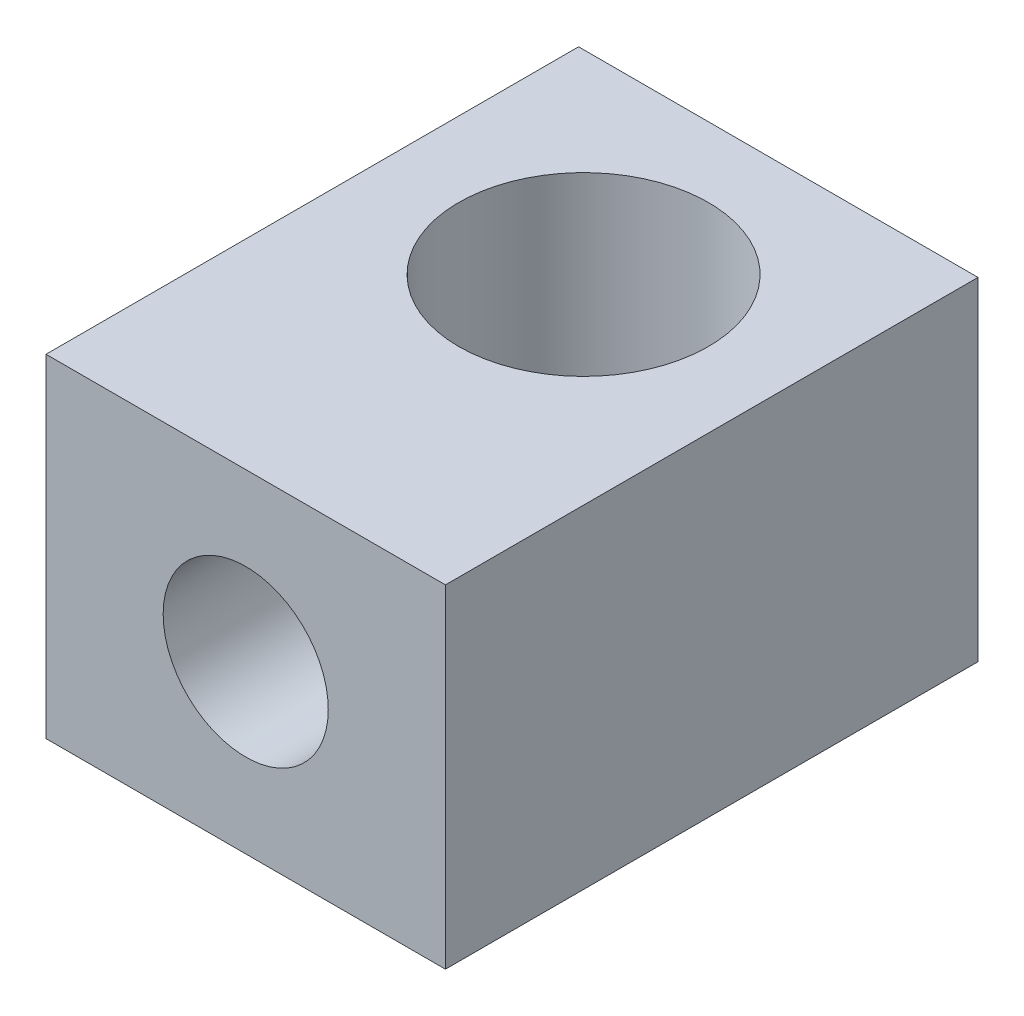
ISO-10303-21;
HEADER;
FILE_DESCRIPTION(('STEP AP214'),'2;1');
FILE_NAME('part.step','',(''),(''),'','','');
FILE_SCHEMA(('AUTOMOTIVE_DESIGN { 1 0 10303 214 1 1 1 1 }'));
ENDSEC;
DATA;
#1=APPLICATION_CONTEXT('core data for automotive mechanical design processes');
#2=APPLICATION_PROTOCOL_DEFINITION('international standard','automotive_design',2000,#1);
#3=PRODUCT_CONTEXT('',#1,'mechanical');
#4=PRODUCT('Part','Part','',(#3));
#5=PRODUCT_RELATED_PRODUCT_CATEGORY('part','',(#4));
#6=PRODUCT_DEFINITION_FORMATION('','',#4);
#7=PRODUCT_DEFINITION_CONTEXT('part definition',#1,'design');
#8=PRODUCT_DEFINITION('design','',#6,#7);
#9=PRODUCT_DEFINITION_SHAPE('','',#8);
#10=(LENGTH_UNIT() NAMED_UNIT(*) SI_UNIT(.MILLI.,.METRE.));
#11=(NAMED_UNIT(*) PLANE_ANGLE_UNIT() SI_UNIT($,.RADIAN.));
#12=(NAMED_UNIT(*) SI_UNIT($,.STERADIAN.) SOLID_ANGLE_UNIT());
#13=UNCERTAINTY_MEASURE_WITH_UNIT(LENGTH_MEASURE(1.E-05),#10,'distance_accuracy_value','');
#14=(GEOMETRIC_REPRESENTATION_CONTEXT(3) GLOBAL_UNCERTAINTY_ASSIGNED_CONTEXT((#13)) GLOBAL_UNIT_ASSIGNED_CONTEXT((#10,
#11,#12)) REPRESENTATION_CONTEXT('',''));
#15=CARTESIAN_POINT('',(0.,0.,0.));
#16=DIRECTION('',(0.,0.,1.));
#17=DIRECTION('',(1.,0.,0.));
#18=AXIS2_PLACEMENT_3D('',#15,#16,#17);
#19=CARTESIAN_POINT('',(30.,25.,-50.75));
#20=DIRECTION('',(0.,-1.,0.));
#21=DIRECTION('',(0.,0.,-1.));
#22=AXIS2_PLACEMENT_3D('',#19,#20,#21);
#23=CYLINDRICAL_SURFACE('',#22,18.75);
#24=CARTESIAN_POINT('',(30.,-25.,-50.75));
#25=DIRECTION('',(0.,1.,0.));
#26=DIRECTION('',(0.,0.,1.));
#27=AXIS2_PLACEMENT_3D('',#24,#25,#26);
#28=CIRCLE('',#27,18.75);
#29=CARTESIAN_POINT('',(30.,-25.,-32.));
#30=VERTEX_POINT('',#29);
#31=EDGE_CURVE('E119',#30,#30,#28,.T.);
#32=ORIENTED_EDGE('',*,*,#31,.F.);
#33=EDGE_LOOP('',(#32));
#34=FACE_BOUND('',#33,.T.);
#35=CARTESIAN_POINT('',(30.,25.,-50.75));
#36=DIRECTION('',(0.,1.,0.));
#37=DIRECTION('',(0.,0.,1.));
#38=AXIS2_PLACEMENT_3D('',#35,#36,#37);
#39=CIRCLE('',#38,18.75);
#40=CARTESIAN_POINT('',(30.,25.,-32.));
#41=VERTEX_POINT('',#40);
#42=EDGE_CURVE('E107',#41,#41,#39,.T.);
#43=ORIENTED_EDGE('',*,*,#42,.T.);
#44=EDGE_LOOP('',(#43));
#45=FACE_BOUND('',#44,.T.);
#46=CARTESIAN_POINT('',(17.6,0.,-36.6857723283502));
#47=CARTESIAN_POINT('',(17.6000026590482,-0.303451665094489,-36.6857678587499));
#48=CARTESIAN_POINT('',(17.6111624127147,-0.606942611437197,-36.6759065553358));
#49=CARTESIAN_POINT('',(17.6555641661901,-1.21107441204242,-36.6369476862313));
#50=CARTESIAN_POINT('',(17.6888103855397,-1.51171471056493,-36.6078464448243));
#51=CARTESIAN_POINT('',(17.7767577569733,-2.10790593224452,-36.5317647464153));
#52=CARTESIAN_POINT('',(17.8314860504961,-2.40344992142466,-36.4847616736574));
#53=CARTESIAN_POINT('',(17.9614475835619,-2.98709161097698,-36.374918181416));
#54=CARTESIAN_POINT('',(18.0366909309395,-3.27518556388194,-36.3120699561263));
#55=CARTESIAN_POINT('',(18.2057445641845,-3.83945689107929,-36.1736554423524));
#56=CARTESIAN_POINT('',(18.2993654223906,-4.11572345599074,-36.0982199975673));
#57=CARTESIAN_POINT('',(18.5045393318759,-4.65816766160607,-35.9366961683205));
#58=CARTESIAN_POINT('',(18.6160912217608,-4.92434595434922,-35.850608473889));
#59=CARTESIAN_POINT('',(18.9763140850921,-5.70683101393221,-35.579940575695));
#60=CARTESIAN_POINT('',(19.2506366619713,-6.20736511738796,-35.3828832145843));
#61=CARTESIAN_POINT('',(19.7317442624667,-6.95914129389991,-35.0601766208809));
#62=CARTESIAN_POINT('',(19.9179711535932,-7.22622909170239,-34.9396055023477));
#63=CARTESIAN_POINT('',(20.3103266251792,-7.74440186575259,-34.6961544899759));
#64=CARTESIAN_POINT('',(20.516456537515,-7.99548576917793,-34.5732744420714));
#65=CARTESIAN_POINT('',(20.9480648031625,-8.48104393240081,-34.3278600720339));
#66=CARTESIAN_POINT('',(21.1735603259832,-8.71550310947092,-34.2053261582853));
#67=CARTESIAN_POINT('',(21.6431388638143,-9.16672754738649,-33.9632446304115));
#68=CARTESIAN_POINT('',(21.8872231295481,-9.38349161559912,-33.8436972179499));
#69=CARTESIAN_POINT('',(22.4291574751828,-9.82760470785355,-33.5934839056241));
#70=CARTESIAN_POINT('',(22.7297284826461,-10.052111999112,-33.4636380793424));
#71=CARTESIAN_POINT('',(23.3530854595164,-10.4747468017044,-33.2145019440331));
#72=CARTESIAN_POINT('',(23.6758740437718,-10.6728711998818,-33.0952128812498));
#73=CARTESIAN_POINT('',(24.3417582206113,-11.0403244114123,-32.8706786654134));
#74=CARTESIAN_POINT('',(24.6848367784285,-11.209676930675,-32.7654219662738));
#75=CARTESIAN_POINT('',(25.3892740323853,-11.5173273558419,-32.5720736425283));
#76=CARTESIAN_POINT('',(25.7506288734642,-11.6556317775992,-32.4839784168747));
#77=CARTESIAN_POINT('',(26.4477287606451,-11.8853160139575,-32.336516242883));
#78=CARTESIAN_POINT('',(26.7818768960241,-11.9801966390343,-32.2750480102847));
#79=CARTESIAN_POINT('',(27.459617654916,-12.1419843361502,-32.1697281339483));
#80=CARTESIAN_POINT('',(27.8032096467807,-12.2088932742342,-32.1258753150597));
#81=CARTESIAN_POINT('',(28.4963370189065,-12.3134770280339,-32.0571493889575));
#82=CARTESIAN_POINT('',(28.8458659414183,-12.3511817593928,-32.0322568600023));
#83=CARTESIAN_POINT('',(29.5476914328078,-12.3967341549573,-32.0021677125926));
#84=CARTESIAN_POINT('',(29.8999876145103,-12.4045859239599,-31.9969683863132));
#85=CARTESIAN_POINT('',(30.5508789306273,-12.3913710200211,-32.0057054214063));
#86=CARTESIAN_POINT('',(30.8496068533582,-12.3744632526169,-32.0168898674684));
#87=CARTESIAN_POINT('',(31.4441788949591,-12.3192312248655,-32.0533285816254));
#88=CARTESIAN_POINT('',(31.7400233748281,-12.280909681437,-32.0785810648068));
#89=CARTESIAN_POINT('',(32.3267606630715,-12.1833758711946,-32.1425875746416));
#90=CARTESIAN_POINT('',(32.6176532575969,-12.1241627045553,-32.1813421828455));
#91=CARTESIAN_POINT('',(33.1925965065269,-11.9856070512779,-32.2715122094351));
#92=CARTESIAN_POINT('',(33.4766468654294,-11.9062636969591,-32.3229281735661));
#93=CARTESIAN_POINT('',(34.0353070508555,-11.7286796976221,-32.4371677819509));
#94=CARTESIAN_POINT('',(34.3099454377582,-11.6305035645523,-32.4999524425631));
#95=CARTESIAN_POINT('',(34.8495343536645,-11.4160564818376,-32.6358628426381));
#96=CARTESIAN_POINT('',(35.1144809334227,-11.2997782551357,-32.7089927398106));
#97=CARTESIAN_POINT('',(35.6334257098113,-11.0502218075615,-32.864241432771));
#98=CARTESIAN_POINT('',(35.8874258504697,-10.9169466220412,-32.9463586232192));
#99=CARTESIAN_POINT('',(36.3836827403314,-10.6343849831504,-33.1182086299192));
#100=CARTESIAN_POINT('',(36.6259381174819,-10.4850966655988,-33.2079423325988));
#101=CARTESIAN_POINT('',(37.1288399657065,-10.1509748890185,-33.4057111453384));
#102=CARTESIAN_POINT('',(37.3877571380653,-9.9640454868874,-33.5146059826153));
#103=CARTESIAN_POINT('',(37.8889153125726,-9.57215882304386,-33.7381564815082));
#104=CARTESIAN_POINT('',(38.1311550787469,-9.3672002277336,-33.8528125690075));
#105=CARTESIAN_POINT('',(38.5986572217184,-8.93999454903315,-34.0858498457613));
#106=CARTESIAN_POINT('',(38.823895062822,-8.71772338663272,-34.2042360817942));
#107=CARTESIAN_POINT('',(39.2564486143453,-8.25699818746805,-34.4422835467446));
#108=CARTESIAN_POINT('',(39.4637628986579,-8.01854286568323,-34.561944876267));
#109=CARTESIAN_POINT('',(39.8900358934314,-7.48864221511725,-34.8182527891971));
#110=CARTESIAN_POINT('',(40.1059618825913,-7.19465657736653,-34.9547116101669));
#111=CARTESIAN_POINT('',(40.5121617902728,-6.58696075215065,-35.2220865062804));
#112=CARTESIAN_POINT('',(40.7024300501385,-6.27324623589872,-35.353001354382));
#113=CARTESIAN_POINT('',(41.0555829291873,-5.62754665936534,-35.604587619228));
#114=CARTESIAN_POINT('',(41.2185113754043,-5.29559199536987,-35.7252752738733));
#115=CARTESIAN_POINT('',(41.5156009990007,-4.61400610647777,-35.9517447517524));
#116=CARTESIAN_POINT('',(41.6497608703012,-4.26437407992783,-36.0575258981634));
#117=CARTESIAN_POINT('',(41.8535520363068,-3.65052308348401,-36.2218284498345));
#118=CARTESIAN_POINT('',(41.9307041449118,-3.39009476151849,-36.2852568359473));
#119=CARTESIAN_POINT('',(42.0681997614938,-2.86231368346927,-36.3997711652531));
#120=CARTESIAN_POINT('',(42.1285540041182,-2.59496546949305,-36.4508649880457));
#121=CARTESIAN_POINT('',(42.231629887841,-2.05492064531051,-36.5389361224932));
#122=CARTESIAN_POINT('',(42.2743727860139,-1.78223090151386,-36.5759304483152));
#123=CARTESIAN_POINT('',(42.3416525556969,-1.2329467676068,-36.6344725873458));
#124=CARTESIAN_POINT('',(42.366189323648,-0.956352355295216,-36.6560203126918));
#125=CARTESIAN_POINT('',(42.3966812320976,-0.400203238024033,-36.682831949384));
#126=CARTESIAN_POINT('',(42.4025598492615,-0.120641048140776,-36.6880287995516));
#127=CARTESIAN_POINT('',(42.3954088410869,0.438050614027775,-36.6817250429448));
#128=CARTESIAN_POINT('',(42.3823791540994,0.717180084899253,-36.6702243817296));
#129=CARTESIAN_POINT('',(42.3376387696218,1.27297415692256,-36.631004123114));
#130=CARTESIAN_POINT('',(42.3059146227557,1.549636837776,-36.6032728490033));
#131=CARTESIAN_POINT('',(42.2243229852511,2.0982999620452,-36.5327104587984));
#132=CARTESIAN_POINT('',(42.1744551685436,2.37030032158004,-36.4898790713329));
#133=CARTESIAN_POINT('',(42.0599503735536,2.8959826981795,-36.3929302638986));
#134=CARTESIAN_POINT('',(41.9960717045788,3.14994053426301,-36.3394017214741));
#135=CARTESIAN_POINT('',(41.8531648390795,3.65108264590335,-36.2216294598068));
#136=CARTESIAN_POINT('',(41.774131743714,3.89826470149897,-36.1573822765161));
#137=CARTESIAN_POINT('',(41.6016704039472,4.3849637725648,-36.0198983074195));
#138=CARTESIAN_POINT('',(41.5082420390899,4.62448072387504,-35.9466614463912));
#139=CARTESIAN_POINT('',(41.3076804012638,5.09527663918147,-35.7929003310647));
#140=CARTESIAN_POINT('',(41.2005465613874,5.32655526190467,-35.7123757753616));
#141=CARTESIAN_POINT('',(40.9504958564109,5.82574872697936,-35.5290369237038));
#142=CARTESIAN_POINT('',(40.8047039524239,6.09176977834419,-35.4249803277127));
#143=CARTESIAN_POINT('',(40.4951892460105,6.61077129553962,-35.2113752061015));
#144=CARTESIAN_POINT('',(40.3314683390407,6.86375313572657,-35.1018272616903));
#145=CARTESIAN_POINT('',(39.9865844721527,7.35653976116386,-34.8795000186303));
#146=CARTESIAN_POINT('',(39.8054010523972,7.59632855947207,-34.7667170410139));
#147=CARTESIAN_POINT('',(39.4263440268431,8.06189551634172,-34.5402715867876));
#148=CARTESIAN_POINT('',(39.2284693227414,8.28767275122902,-34.4266090527495));
#149=CARTESIAN_POINT('',(38.7730850701976,8.7706989572077,-34.1766360560002));
#150=CARTESIAN_POINT('',(38.5117980246157,9.02454767182415,-34.0406028719818));
#151=CARTESIAN_POINT('',(37.9663316701778,9.50950859664155,-33.7737734619729));
#152=CARTESIAN_POINT('',(37.6821482375876,9.74061669443924,-33.6429781857301));
#153=CARTESIAN_POINT('',(37.0921371814952,10.178230923954,-33.3900740176457));
#154=CARTESIAN_POINT('',(36.7863256545504,10.3847550512648,-33.2679587986673));
#155=CARTESIAN_POINT('',(36.1542226593195,10.7713837594528,-33.0355611304903));
#156=CARTESIAN_POINT('',(35.8279367944712,10.9514955242512,-32.925275465961));
#157=CARTESIAN_POINT('',(35.2219442064174,11.2508785330516,-32.7396193600065));
#158=CARTESIAN_POINT('',(34.945510844972,11.3751707848063,-32.6616290025164));
#159=CARTESIAN_POINT('',(34.3817610080501,11.6039936863794,-32.5168622210417));
#160=CARTESIAN_POINT('',(34.0944465623454,11.708528000286,-32.4500837180879));
#161=CARTESIAN_POINT('',(33.5106282208039,11.8966163033994,-32.3291750364433));
#162=CARTESIAN_POINT('',(33.2141302813609,11.9801835843967,-32.2750368461021));
#163=CARTESIAN_POINT('',(32.6136243243055,12.1253609283482,-32.1805671370104));
#164=CARTESIAN_POINT('',(32.3096161904836,12.1869706513131,-32.1402358320451));
#165=CARTESIAN_POINT('',(31.6949524911841,12.2875759501645,-32.0741981765604));
#166=CARTESIAN_POINT('',(31.3842741355382,12.3264741337103,-32.0485548201591));
#167=CARTESIAN_POINT('',(30.759967625848,12.3806549441236,-32.0127990068183));
#168=CARTESIAN_POINT('',(30.4463394681162,12.3959375414664,-32.0026865692958));
#169=CARTESIAN_POINT('',(29.8187259217592,12.4026458926612,-31.9982502378739));
#170=CARTESIAN_POINT('',(29.504740543774,12.394072339411,-32.0039258854123));
#171=CARTESIAN_POINT('',(28.8790083351746,12.3532049313161,-32.0309205407085));
#172=CARTESIAN_POINT('',(28.567261413735,12.3209120444376,-32.0522389100998));
#173=CARTESIAN_POINT('',(27.9697048840757,12.2361205967917,-32.1079988299704));
#174=CARTESIAN_POINT('',(27.6835814778256,12.1851578175416,-32.1414413029311));
#175=CARTESIAN_POINT('',(27.117277389678,12.0637376518345,-32.2207217718415));
#176=CARTESIAN_POINT('',(26.837096382661,11.9932813348822,-32.2665590877502));
#177=CARTESIAN_POINT('',(26.2842714020213,11.8336869753719,-32.3697132269247));
#178=CARTESIAN_POINT('',(26.0116278957106,11.7445477774348,-32.4270307601356));
#179=CARTESIAN_POINT('',(25.4752597079406,11.5485180862204,-32.5520585539462));
#180=CARTESIAN_POINT('',(25.2115355032542,11.4416266458131,-32.6197693690409));
#181=CARTESIAN_POINT('',(24.6782127186663,11.2039714514874,-32.7688324000324));
#182=CARTESIAN_POINT('',(24.4092520461432,11.0721431507026,-32.8507678044803));
#183=CARTESIAN_POINT('',(23.8836654052993,10.7907070345371,-33.0234800178915));
#184=CARTESIAN_POINT('',(23.6270436911403,10.6410931479985,-33.1142598440031));
#185=CARTESIAN_POINT('',(23.1269768868199,10.325166155095,-33.3030659538458));
#186=CARTESIAN_POINT('',(22.8835363145103,10.158847378179,-33.4010946952557));
#187=CARTESIAN_POINT('',(22.4105732536553,9.81054887229316,-33.6027202024855));
#188=CARTESIAN_POINT('',(22.1810515197356,9.62856829549266,-33.7063172696253));
#189=CARTESIAN_POINT('',(21.7015133009135,9.22004940700727,-33.9339755202321));
#190=CARTESIAN_POINT('',(21.4539420493404,8.99100249599667,-34.0586947354844));
#191=CARTESIAN_POINT('',(20.9789127941637,8.51429416100897,-34.3105731408528));
#192=CARTESIAN_POINT('',(20.7514509410658,8.26663631654432,-34.4377318582842));
#193=CARTESIAN_POINT('',(20.3170930158037,7.75335033044184,-34.6917573004896));
#194=CARTESIAN_POINT('',(20.1102142007954,7.48770741819707,-34.8186236945685));
#195=CARTESIAN_POINT('',(19.7180563037971,6.93939655893929,-35.0688577539193));
#196=CARTESIAN_POINT('',(19.5327747788137,6.65673054300383,-35.1922258137109));
#197=CARTESIAN_POINT('',(19.2006375735023,6.10152963843422,-35.4211651545217));
#198=CARTESIAN_POINT('',(19.051819243052,5.83041546272734,-35.5273341185061));
#199=CARTESIAN_POINT('',(18.7737594750403,5.27521557797171,-35.7312201353187));
#200=CARTESIAN_POINT('',(18.6445185322144,4.9911295413502,-35.8289369745285));
#201=CARTESIAN_POINT('',(18.4069666451139,4.41129928027293,-36.0127477081356));
#202=CARTESIAN_POINT('',(18.2986193352405,4.1155764104085,-36.0988617171924));
#203=CARTESIAN_POINT('',(18.1038922577526,3.51322040993853,-36.2565240140823));
#204=CARTESIAN_POINT('',(18.0175060898401,3.20659048782073,-36.3280765444591));
#205=CARTESIAN_POINT('',(17.8865818327023,2.66139916133276,-36.4380129304842));
#206=CARTESIAN_POINT('',(17.8369784966089,2.42481419688672,-36.4802218930097));
#207=CARTESIAN_POINT('',(17.7514891535536,1.94749507194557,-36.5535333888944));
#208=CARTESIAN_POINT('',(17.7156006728207,1.70676166790572,-36.5846379251106));
#209=CARTESIAN_POINT('',(17.6579925938059,1.22241763900481,-36.6348017657818));
#210=CARTESIAN_POINT('',(17.6362689582052,0.978807854153181,-36.6538645023886));
#211=CARTESIAN_POINT('',(17.6072734751982,0.4901403238834,-36.679349937576));
#212=CARTESIAN_POINT('',(17.5999978524176,0.245082973516482,-36.6857759382264));
#213=CARTESIAN_POINT('',(17.6,0.,-36.6857723283502));
#214=B_SPLINE_CURVE_WITH_KNOTS('',3,(#46,#47,#48,#49,#50,#51,#52,#53,#54,#55,#56,#57,#58,#59,
#60,#61,#62,#63,#64,#65,#66,#67,#68,#69,#70,#71,#72,#73,#74,#75,#76,#77,#78,#79,#80,#81,#82,#83,
#84,#85,#86,#87,#88,#89,#90,#91,#92,#93,#94,#95,#96,#97,#98,#99,#100,#101,#102,#103,#104,#105,
#106,#107,#108,#109,#110,#111,#112,#113,#114,#115,#116,#117,#118,#119,#120,#121,#122,#123,#124,
#125,#126,#127,#128,#129,#130,#131,#132,#133,#134,#135,#136,#137,#138,#139,#140,#141,#142,#143,
#144,#145,#146,#147,#148,#149,#150,#151,#152,#153,#154,#155,#156,#157,#158,#159,#160,#161,#162,
#163,#164,#165,#166,#167,#168,#169,#170,#171,#172,#173,#174,#175,#176,#177,#178,#179,#180,#181,
#182,#183,#184,#185,#186,#187,#188,#189,#190,#191,#192,#193,#194,#195,#196,#197,#198,#199,#200,
#201,#202,#203,#204,#205,#206,#207,#208,#209,#210,#211,#212,#213),.UNSPECIFIED.,.T.,.F.,(4,2,2,
2,2,2,2,2,2,2,2,2,2,2,2,2,2,2,2,2,2,2,2,2,2,2,2,2,2,2,2,2,2,2,2,2,2,2,2,2,2,2,2,2,2,2,2,2,2,2,2,
2,2,2,2,2,2,2,2,2,2,2,2,2,2,2,2,2,2,2,2,2,2,2,2,2,2,2,2,2,2,2,2,4),(0.,0.91006483674696,
1.8203035881609,2.73169609800909,3.64353846795293,4.54643362302567,5.44927032105237,
7.25405628556979,8.29495452226847,9.33592246244076,10.3778230435323,11.4197937898131,
12.6091910726489,13.798728579113,14.9872811904646,16.1755841346967,17.2322612417229,
18.2888678445317,19.3443906642933,20.3997683438926,21.2969266173332,22.1939710877364,
23.0910541995564,23.988175985327,24.8822778416607,25.7767400602837,26.6710427670912,
27.5654496980646,28.5766498462371,29.587924854668,30.6006324013704,31.6134204512284,
32.7804060150856,33.9476485310422,35.1130016457723,36.2784076557563,37.1144097018528,
37.9498762691449,38.7843314445231,39.6187913663605,40.456669295123,41.294549955723,
42.1330341509381,42.971533415718,43.7726177409225,44.5739614636662,45.3753118922211,
46.1766954782256,47.1379229649465,48.0990489284986,49.0613150045234,50.0236444480804,
51.1888588648295,52.3542836126698,53.5188499480338,54.6830989421574,55.6210533170307,
56.5588335782465,57.4960178346115,58.4332166016412,59.3744053244431,60.3155952239376,
61.2567577870223,62.1978819441762,63.0745327323254,63.9511354329337,64.8277923600541,
65.7044960742188,66.6351734864707,67.566169505175,68.4974826297242,69.4288462014157,
70.5065318292763,71.5840107096188,72.6623854850274,73.7406381606643,74.7207205773758,
75.7008277573845,76.6792133407246,77.6573134581949,78.3928626101665,79.1282790272373,
79.8634857413498,80.5985003151314),.UNSPECIFIED.);
#215=CARTESIAN_POINT('',(17.6,0.,-36.6857723283502));
#216=VERTEX_POINT('',#215);
#217=EDGE_CURVE('E37',#216,#216,#214,.T.);
#218=ORIENTED_EDGE('',*,*,#217,.T.);
#219=EDGE_LOOP('',(#218));
#220=FACE_BOUND('',#219,.T.);
#221=ADVANCED_FACE('F33',(#34,#45,#220),#23,.F.);
#222=CARTESIAN_POINT('',(0.,25.,0.));
#223=DIRECTION('',(0.,1.,0.));
#224=DIRECTION('',(0.,0.,1.));
#225=AXIS2_PLACEMENT_3D('',#222,#223,#224);
#226=PLANE('',#225);
#227=DIRECTION('',(0.,0.,1.));
#228=VECTOR('',#227,1.);
#229=CARTESIAN_POINT('',(0.,25.,-80.));
#230=LINE('',#229,#228);
#231=CARTESIAN_POINT('',(0.,25.,-80.));
#232=VERTEX_POINT('',#231);
#233=CARTESIAN_POINT('',(0.,25.,0.));
#234=VERTEX_POINT('',#233);
#235=EDGE_CURVE('E91',#232,#234,#230,.T.);
#236=ORIENTED_EDGE('',*,*,#235,.T.);
#237=DIRECTION('',(1.,0.,0.));
#238=VECTOR('',#237,1.);
#239=CARTESIAN_POINT('',(0.,25.,0.));
#240=LINE('',#239,#238);
#241=CARTESIAN_POINT('',(60.,25.,0.));
#242=VERTEX_POINT('',#241);
#243=EDGE_CURVE('E85',#234,#242,#240,.T.);
#244=ORIENTED_EDGE('',*,*,#243,.T.);
#245=DIRECTION('',(0.,0.,-1.));
#246=VECTOR('',#245,1.);
#247=CARTESIAN_POINT('',(60.,25.,0.));
#248=LINE('',#247,#246);
#249=CARTESIAN_POINT('',(60.,25.,-80.));
#250=VERTEX_POINT('',#249);
#251=EDGE_CURVE('E89',#242,#250,#248,.T.);
#252=ORIENTED_EDGE('',*,*,#251,.T.);
#253=DIRECTION('',(-1.,0.,0.));
#254=VECTOR('',#253,1.);
#255=CARTESIAN_POINT('',(60.,25.,-80.));
#256=LINE('',#255,#254);
#257=EDGE_CURVE('E55',#250,#232,#256,.T.);
#258=ORIENTED_EDGE('',*,*,#257,.T.);
#259=EDGE_LOOP('',(#236,#244,#252,#258));
#260=FACE_BOUND('',#259,.T.);
#261=ORIENTED_EDGE('',*,*,#42,.F.);
#262=EDGE_LOOP('',(#261));
#263=FACE_BOUND('',#262,.T.);
#264=ADVANCED_FACE('F86',(#260,#263),#226,.T.);
#265=CARTESIAN_POINT('',(0.,-25.,0.));
#266=DIRECTION('',(0.,1.,0.));
#267=DIRECTION('',(0.,0.,1.));
#268=AXIS2_PLACEMENT_3D('',#265,#266,#267);
#269=PLANE('',#268);
#270=DIRECTION('',(0.,0.,1.));
#271=VECTOR('',#270,1.);
#272=CARTESIAN_POINT('',(0.,-25.,-80.));
#273=LINE('',#272,#271);
#274=CARTESIAN_POINT('',(0.,-25.,-80.));
#275=VERTEX_POINT('',#274);
#276=CARTESIAN_POINT('',(0.,-25.,0.));
#277=VERTEX_POINT('',#276);
#278=EDGE_CURVE('E104',#275,#277,#273,.T.);
#279=ORIENTED_EDGE('',*,*,#278,.F.);
#280=DIRECTION('',(-1.,0.,0.));
#281=VECTOR('',#280,1.);
#282=CARTESIAN_POINT('',(60.,-25.,-80.));
#283=LINE('',#282,#281);
#284=CARTESIAN_POINT('',(60.,-25.,-80.));
#285=VERTEX_POINT('',#284);
#286=EDGE_CURVE('E78',#285,#275,#283,.T.);
#287=ORIENTED_EDGE('',*,*,#286,.F.);
#288=DIRECTION('',(0.,0.,-1.));
#289=VECTOR('',#288,1.);
#290=CARTESIAN_POINT('',(60.,-25.,0.));
#291=LINE('',#290,#289);
#292=CARTESIAN_POINT('',(60.,-25.,0.));
#293=VERTEX_POINT('',#292);
#294=EDGE_CURVE('E72',#293,#285,#291,.T.);
#295=ORIENTED_EDGE('',*,*,#294,.F.);
#296=DIRECTION('',(1.,0.,0.));
#297=VECTOR('',#296,1.);
#298=CARTESIAN_POINT('',(0.,-25.,0.));
#299=LINE('',#298,#297);
#300=EDGE_CURVE('E95',#277,#293,#299,.T.);
#301=ORIENTED_EDGE('',*,*,#300,.F.);
#302=EDGE_LOOP('',(#279,#287,#295,#301));
#303=FACE_BOUND('',#302,.T.);
#304=ORIENTED_EDGE('',*,*,#31,.T.);
#305=EDGE_LOOP('',(#304));
#306=FACE_BOUND('',#305,.T.);
#307=ADVANCED_FACE('F115',(#303,#306),#269,.F.);
#308=CARTESIAN_POINT('',(0.,25.,-80.));
#309=DIRECTION('',(1.,0.,0.));
#310=DIRECTION('',(0.,0.,-1.));
#311=AXIS2_PLACEMENT_3D('',#308,#309,#310);
#312=PLANE('',#311);
#313=ORIENTED_EDGE('',*,*,#278,.T.);
#314=DIRECTION('',(0.,-1.,0.));
#315=VECTOR('',#314,1.);
#316=CARTESIAN_POINT('',(0.,25.,0.));
#317=LINE('',#316,#315);
#318=EDGE_CURVE('E11',#234,#277,#317,.T.);
#319=ORIENTED_EDGE('',*,*,#318,.F.);
#320=ORIENTED_EDGE('',*,*,#235,.F.);
#321=DIRECTION('',(0.,-1.,0.));
#322=VECTOR('',#321,1.);
#323=CARTESIAN_POINT('',(0.,25.,-80.));
#324=LINE('',#323,#322);
#325=EDGE_CURVE('E100',#232,#275,#324,.T.);
#326=ORIENTED_EDGE('',*,*,#325,.T.);
#327=EDGE_LOOP('',(#313,#319,#320,#326));
#328=FACE_BOUND('',#327,.T.);
#329=ADVANCED_FACE('F35',(#328),#312,.F.);
#330=CARTESIAN_POINT('',(0.,25.,0.));
#331=DIRECTION('',(0.,0.,-1.));
#332=DIRECTION('',(-1.,0.,0.));
#333=AXIS2_PLACEMENT_3D('',#330,#331,#332);
#334=PLANE('',#333);
#335=CARTESIAN_POINT('',(30.,0.,0.));
#336=DIRECTION('',(0.,0.,1.));
#337=DIRECTION('',(1.,0.,0.));
#338=AXIS2_PLACEMENT_3D('',#335,#336,#337);
#339=CIRCLE('',#338,12.4);
#340=CARTESIAN_POINT('',(42.4,0.,0.));
#341=VERTEX_POINT('',#340);
#342=EDGE_CURVE('E124',#341,#341,#339,.T.);
#343=ORIENTED_EDGE('',*,*,#342,.F.);
#344=EDGE_LOOP('',(#343));
#345=FACE_BOUND('',#344,.T.);
#346=ORIENTED_EDGE('',*,*,#300,.T.);
#347=DIRECTION('',(0.,-1.,0.));
#348=VECTOR('',#347,1.);
#349=CARTESIAN_POINT('',(60.,25.,0.));
#350=LINE('',#349,#348);
#351=EDGE_CURVE('E47',#242,#293,#350,.T.);
#352=ORIENTED_EDGE('',*,*,#351,.F.);
#353=ORIENTED_EDGE('',*,*,#243,.F.);
#354=ORIENTED_EDGE('',*,*,#318,.T.);
#355=EDGE_LOOP('',(#346,#352,#353,#354));
#356=FACE_BOUND('',#355,.T.);
#357=ADVANCED_FACE('F94',(#345,#356),#334,.F.);
#358=CARTESIAN_POINT('',(60.,25.,0.));
#359=DIRECTION('',(-1.,0.,0.));
#360=DIRECTION('',(0.,0.,1.));
#361=AXIS2_PLACEMENT_3D('',#358,#359,#360);
#362=PLANE('',#361);
#363=ORIENTED_EDGE('',*,*,#294,.T.);
#364=DIRECTION('',(0.,-1.,0.));
#365=VECTOR('',#364,1.);
#366=CARTESIAN_POINT('',(60.,25.,-80.));
#367=LINE('',#366,#365);
#368=EDGE_CURVE('E96',#250,#285,#367,.T.);
#369=ORIENTED_EDGE('',*,*,#368,.F.);
#370=ORIENTED_EDGE('',*,*,#251,.F.);
#371=ORIENTED_EDGE('',*,*,#351,.T.);
#372=EDGE_LOOP('',(#363,#369,#370,#371));
#373=FACE_BOUND('',#372,.T.);
#374=ADVANCED_FACE('F98',(#373),#362,.F.);
#375=CARTESIAN_POINT('',(60.,25.,-80.));
#376=DIRECTION('',(0.,0.,1.));
#377=DIRECTION('',(1.,0.,0.));
#378=AXIS2_PLACEMENT_3D('',#375,#376,#377);
#379=PLANE('',#378);
#380=ORIENTED_EDGE('',*,*,#286,.T.);
#381=ORIENTED_EDGE('',*,*,#325,.F.);
#382=ORIENTED_EDGE('',*,*,#257,.F.);
#383=ORIENTED_EDGE('',*,*,#368,.T.);
#384=EDGE_LOOP('',(#380,#381,#382,#383));
#385=FACE_BOUND('',#384,.T.);
#386=ADVANCED_FACE('F112',(#385),#379,.F.);
#387=CARTESIAN_POINT('',(30.,0.,0.));
#388=DIRECTION('',(0.,0.,-1.));
#389=DIRECTION('',(-1.,0.,0.));
#390=AXIS2_PLACEMENT_3D('',#387,#388,#389);
#391=CYLINDRICAL_SURFACE('',#390,12.4);
#392=ORIENTED_EDGE('',*,*,#217,.F.);
#393=EDGE_LOOP('',(#392));
#394=FACE_BOUND('',#393,.T.);
#395=ORIENTED_EDGE('',*,*,#342,.T.);
#396=EDGE_LOOP('',(#395));
#397=FACE_BOUND('',#396,.T.);
#398=ADVANCED_FACE('F132',(#394,#397),#391,.F.);
#399=CLOSED_SHELL('',(#221,#264,#307,#329,#357,#374,#386,#398));
#400=MANIFOLD_SOLID_BREP('B2',#399);
#401=ADVANCED_BREP_SHAPE_REPRESENTATION('',(#18,#400),#14);
#402=SHAPE_DEFINITION_REPRESENTATION(#9,#401);
ENDSEC;
END-ISO-10303-21;
